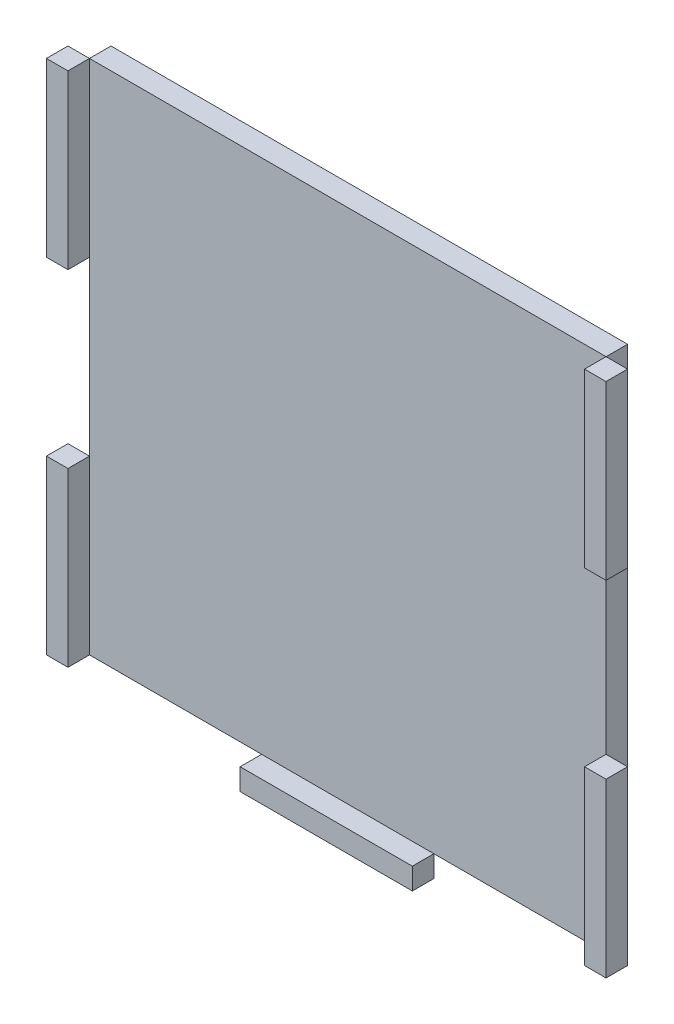
ISO-10303-21;
HEADER;
FILE_DESCRIPTION(('STEP AP214'),'2;1');
FILE_NAME('part.step','',(''),(''),'','','');
FILE_SCHEMA(('AUTOMOTIVE_DESIGN { 1 0 10303 214 1 1 1 1 }'));
ENDSEC;
DATA;
#1=APPLICATION_CONTEXT('core data for automotive mechanical design processes');
#2=APPLICATION_PROTOCOL_DEFINITION('international standard','automotive_design',2000,#1);
#3=PRODUCT_CONTEXT('',#1,'mechanical');
#4=PRODUCT('Part','Part','',(#3));
#5=PRODUCT_RELATED_PRODUCT_CATEGORY('part','',(#4));
#6=PRODUCT_DEFINITION_FORMATION('','',#4);
#7=PRODUCT_DEFINITION_CONTEXT('part definition',#1,'design');
#8=PRODUCT_DEFINITION('design','',#6,#7);
#9=PRODUCT_DEFINITION_SHAPE('','',#8);
#10=(LENGTH_UNIT() NAMED_UNIT(*) SI_UNIT(.MILLI.,.METRE.));
#11=(NAMED_UNIT(*) PLANE_ANGLE_UNIT() SI_UNIT($,.RADIAN.));
#12=(NAMED_UNIT(*) SI_UNIT($,.STERADIAN.) SOLID_ANGLE_UNIT());
#13=UNCERTAINTY_MEASURE_WITH_UNIT(LENGTH_MEASURE(1.E-05),#10,'distance_accuracy_value','');
#14=(GEOMETRIC_REPRESENTATION_CONTEXT(3) GLOBAL_UNCERTAINTY_ASSIGNED_CONTEXT((#13)) GLOBAL_UNIT_ASSIGNED_CONTEXT((#10,
#11,#12)) REPRESENTATION_CONTEXT('',''));
#15=CARTESIAN_POINT('',(0.,0.,0.));
#16=DIRECTION('',(0.,0.,1.));
#17=DIRECTION('',(1.,0.,0.));
#18=AXIS2_PLACEMENT_3D('',#15,#16,#17);
#19=CARTESIAN_POINT('',(38.1,-38.1,6.35));
#20=DIRECTION('',(1.,0.,0.));
#21=DIRECTION('',(0.,0.,-1.));
#22=AXIS2_PLACEMENT_3D('',#19,#20,#21);
#23=PLANE('',#22);
#24=DIRECTION('',(0.,-1.,0.));
#25=VECTOR('',#24,1.);
#26=CARTESIAN_POINT('',(38.1,-38.1,3.175));
#27=LINE('',#26,#25);
#28=CARTESIAN_POINT('',(38.1,-12.7,3.175));
#29=VERTEX_POINT('',#28);
#30=CARTESIAN_POINT('',(38.1,-38.1,3.175));
#31=VERTEX_POINT('',#30);
#32=EDGE_CURVE('E113',#29,#31,#27,.T.);
#33=ORIENTED_EDGE('',*,*,#32,.T.);
#34=DIRECTION('',(0.,0.,-1.));
#35=VECTOR('',#34,1.);
#36=CARTESIAN_POINT('',(38.1,-38.1,6.35));
#37=LINE('',#36,#35);
#38=CARTESIAN_POINT('',(38.1,-38.1,6.35));
#39=VERTEX_POINT('',#38);
#40=EDGE_CURVE('E12',#39,#31,#37,.T.);
#41=ORIENTED_EDGE('',*,*,#40,.F.);
#42=DIRECTION('',(0.,-1.,0.));
#43=VECTOR('',#42,1.);
#44=CARTESIAN_POINT('',(38.1,-38.1,6.35));
#45=LINE('',#44,#43);
#46=CARTESIAN_POINT('',(38.1,-12.7,6.35));
#47=VERTEX_POINT('',#46);
#48=EDGE_CURVE('E101',#47,#39,#45,.T.);
#49=ORIENTED_EDGE('',*,*,#48,.F.);
#50=DIRECTION('',(0.,0.,-1.));
#51=VECTOR('',#50,1.);
#52=CARTESIAN_POINT('',(38.1,-12.7,6.35));
#53=LINE('',#52,#51);
#54=EDGE_CURVE('E109',#47,#29,#53,.T.);
#55=ORIENTED_EDGE('',*,*,#54,.T.);
#56=EDGE_LOOP('',(#33,#41,#49,#55));
#57=FACE_BOUND('',#56,.T.);
#58=ADVANCED_FACE('F50',(#57),#23,.F.);
#59=CARTESIAN_POINT('',(38.1,-38.1,6.35));
#60=DIRECTION('',(0.,1.,0.));
#61=DIRECTION('',(0.,0.,1.));
#62=AXIS2_PLACEMENT_3D('',#59,#60,#61);
#63=PLANE('',#62);
#64=DIRECTION('',(1.,0.,0.));
#65=VECTOR('',#64,1.);
#66=CARTESIAN_POINT('',(38.1,-38.1,3.175));
#67=LINE('',#66,#65);
#68=CARTESIAN_POINT('',(41.275,-38.1,3.175));
#69=VERTEX_POINT('',#68);
#70=EDGE_CURVE('E105',#31,#69,#67,.T.);
#71=ORIENTED_EDGE('',*,*,#70,.T.);
#72=DIRECTION('',(0.,0.,-1.));
#73=VECTOR('',#72,1.);
#74=CARTESIAN_POINT('',(41.275,-38.1,6.35));
#75=LINE('',#74,#73);
#76=CARTESIAN_POINT('',(41.275,-38.1,6.35));
#77=VERTEX_POINT('',#76);
#78=EDGE_CURVE('E58',#77,#69,#75,.T.);
#79=ORIENTED_EDGE('',*,*,#78,.F.);
#80=DIRECTION('',(1.,0.,0.));
#81=VECTOR('',#80,1.);
#82=CARTESIAN_POINT('',(38.1,-38.1,6.35));
#83=LINE('',#82,#81);
#84=EDGE_CURVE('E96',#39,#77,#83,.T.);
#85=ORIENTED_EDGE('',*,*,#84,.F.);
#86=ORIENTED_EDGE('',*,*,#40,.T.);
#87=EDGE_LOOP('',(#71,#79,#85,#86));
#88=FACE_BOUND('',#87,.T.);
#89=ADVANCED_FACE('F104',(#88),#63,.F.);
#90=CARTESIAN_POINT('',(41.275,-38.1,6.35));
#91=DIRECTION('',(-1.,0.,0.));
#92=DIRECTION('',(0.,0.,1.));
#93=AXIS2_PLACEMENT_3D('',#90,#91,#92);
#94=PLANE('',#93);
#95=DIRECTION('',(0.,1.,0.));
#96=VECTOR('',#95,1.);
#97=CARTESIAN_POINT('',(41.275,-38.1,3.175));
#98=LINE('',#97,#96);
#99=CARTESIAN_POINT('',(41.275,-12.7,3.175));
#100=VERTEX_POINT('',#99);
#101=EDGE_CURVE('E83',#69,#100,#98,.T.);
#102=ORIENTED_EDGE('',*,*,#101,.T.);
#103=DIRECTION('',(0.,0.,-1.));
#104=VECTOR('',#103,1.);
#105=CARTESIAN_POINT('',(41.275,-12.7,6.35));
#106=LINE('',#105,#104);
#107=CARTESIAN_POINT('',(41.275,-12.7,6.35));
#108=VERTEX_POINT('',#107);
#109=EDGE_CURVE('E106',#108,#100,#106,.T.);
#110=ORIENTED_EDGE('',*,*,#109,.F.);
#111=DIRECTION('',(0.,1.,0.));
#112=VECTOR('',#111,1.);
#113=CARTESIAN_POINT('',(41.275,-38.1,6.35));
#114=LINE('',#113,#112);
#115=EDGE_CURVE('E99',#77,#108,#114,.T.);
#116=ORIENTED_EDGE('',*,*,#115,.F.);
#117=ORIENTED_EDGE('',*,*,#78,.T.);
#118=EDGE_LOOP('',(#102,#110,#116,#117));
#119=FACE_BOUND('',#118,.T.);
#120=ADVANCED_FACE('F107',(#119),#94,.F.);
#121=CARTESIAN_POINT('',(38.1,-12.7,6.35));
#122=DIRECTION('',(0.,-1.,0.));
#123=DIRECTION('',(0.,0.,-1.));
#124=AXIS2_PLACEMENT_3D('',#121,#122,#123);
#125=PLANE('',#124);
#126=DIRECTION('',(-1.,0.,0.));
#127=VECTOR('',#126,1.);
#128=CARTESIAN_POINT('',(38.1,-12.7,3.175));
#129=LINE('',#128,#127);
#130=EDGE_CURVE('E89',#100,#29,#129,.T.);
#131=ORIENTED_EDGE('',*,*,#130,.T.);
#132=ORIENTED_EDGE('',*,*,#54,.F.);
#133=DIRECTION('',(-1.,0.,0.));
#134=VECTOR('',#133,1.);
#135=CARTESIAN_POINT('',(38.1,-12.7,6.35));
#136=LINE('',#135,#134);
#137=EDGE_CURVE('E66',#108,#47,#136,.T.);
#138=ORIENTED_EDGE('',*,*,#137,.F.);
#139=ORIENTED_EDGE('',*,*,#109,.T.);
#140=EDGE_LOOP('',(#131,#132,#138,#139));
#141=FACE_BOUND('',#140,.T.);
#142=ADVANCED_FACE('F120',(#141),#125,.F.);
#143=CARTESIAN_POINT('',(0.,0.,6.35));
#144=DIRECTION('',(0.,0.,-1.));
#145=DIRECTION('',(-1.,0.,0.));
#146=AXIS2_PLACEMENT_3D('',#143,#144,#145);
#147=PLANE('',#146);
#148=ORIENTED_EDGE('',*,*,#48,.T.);
#149=ORIENTED_EDGE('',*,*,#84,.T.);
#150=ORIENTED_EDGE('',*,*,#115,.T.);
#151=ORIENTED_EDGE('',*,*,#137,.T.);
#152=EDGE_LOOP('',(#148,#149,#150,#151));
#153=FACE_BOUND('',#152,.T.);
#154=ADVANCED_FACE('F97',(#153),#147,.F.);
#155=CARTESIAN_POINT('',(0.,0.,3.175));
#156=DIRECTION('',(0.,0.,-1.));
#157=DIRECTION('',(-1.,0.,0.));
#158=AXIS2_PLACEMENT_3D('',#155,#156,#157);
#159=PLANE('',#158);
#160=ORIENTED_EDGE('',*,*,#32,.F.);
#161=ORIENTED_EDGE('',*,*,#130,.F.);
#162=ORIENTED_EDGE('',*,*,#101,.F.);
#163=ORIENTED_EDGE('',*,*,#70,.F.);
#164=EDGE_LOOP('',(#160,#161,#162,#163));
#165=FACE_BOUND('',#164,.T.);
#166=ADVANCED_FACE('F123',(#165),#159,.T.);
#167=CLOSED_SHELL('',(#58,#89,#120,#142,#154,#166));
#168=MANIFOLD_SOLID_BREP('B2',#167);
#169=CARTESIAN_POINT('',(38.1,38.1,6.35));
#170=DIRECTION('',(1.,0.,0.));
#171=DIRECTION('',(0.,0.,-1.));
#172=AXIS2_PLACEMENT_3D('',#169,#170,#171);
#173=PLANE('',#172);
#174=DIRECTION('',(0.,-1.,0.));
#175=VECTOR('',#174,1.);
#176=CARTESIAN_POINT('',(38.1,38.1,3.175));
#177=LINE('',#176,#175);
#178=CARTESIAN_POINT('',(38.1,38.1,3.175));
#179=VERTEX_POINT('',#178);
#180=CARTESIAN_POINT('',(38.1,12.7,3.175));
#181=VERTEX_POINT('',#180);
#182=EDGE_CURVE('E247',#179,#181,#177,.T.);
#183=ORIENTED_EDGE('',*,*,#182,.T.);
#184=DIRECTION('',(0.,0.,-1.));
#185=VECTOR('',#184,1.);
#186=CARTESIAN_POINT('',(38.1,12.7,6.35));
#187=LINE('',#186,#185);
#188=CARTESIAN_POINT('',(38.1,12.7,6.35));
#189=VERTEX_POINT('',#188);
#190=EDGE_CURVE('E48',#189,#181,#187,.T.);
#191=ORIENTED_EDGE('',*,*,#190,.F.);
#192=DIRECTION('',(0.,-1.,0.));
#193=VECTOR('',#192,1.);
#194=CARTESIAN_POINT('',(38.1,38.1,6.35));
#195=LINE('',#194,#193);
#196=CARTESIAN_POINT('',(38.1,38.1,6.35));
#197=VERTEX_POINT('',#196);
#198=EDGE_CURVE('E235',#197,#189,#195,.T.);
#199=ORIENTED_EDGE('',*,*,#198,.F.);
#200=DIRECTION('',(0.,0.,-1.));
#201=VECTOR('',#200,1.);
#202=CARTESIAN_POINT('',(38.1,38.1,6.35));
#203=LINE('',#202,#201);
#204=EDGE_CURVE('E243',#197,#179,#203,.T.);
#205=ORIENTED_EDGE('',*,*,#204,.T.);
#206=EDGE_LOOP('',(#183,#191,#199,#205));
#207=FACE_BOUND('',#206,.T.);
#208=ADVANCED_FACE('F184',(#207),#173,.F.);
#209=CARTESIAN_POINT('',(38.1,12.7,6.35));
#210=DIRECTION('',(0.,1.,0.));
#211=DIRECTION('',(0.,0.,1.));
#212=AXIS2_PLACEMENT_3D('',#209,#210,#211);
#213=PLANE('',#212);
#214=DIRECTION('',(1.,0.,0.));
#215=VECTOR('',#214,1.);
#216=CARTESIAN_POINT('',(38.1,12.7,3.175));
#217=LINE('',#216,#215);
#218=CARTESIAN_POINT('',(41.275,12.7,3.175));
#219=VERTEX_POINT('',#218);
#220=EDGE_CURVE('E239',#181,#219,#217,.T.);
#221=ORIENTED_EDGE('',*,*,#220,.T.);
#222=DIRECTION('',(0.,0.,-1.));
#223=VECTOR('',#222,1.);
#224=CARTESIAN_POINT('',(41.275,12.7,6.35));
#225=LINE('',#224,#223);
#226=CARTESIAN_POINT('',(41.275,12.7,6.35));
#227=VERTEX_POINT('',#226);
#228=EDGE_CURVE('E192',#227,#219,#225,.T.);
#229=ORIENTED_EDGE('',*,*,#228,.F.);
#230=DIRECTION('',(1.,0.,0.));
#231=VECTOR('',#230,1.);
#232=CARTESIAN_POINT('',(38.1,12.7,6.35));
#233=LINE('',#232,#231);
#234=EDGE_CURVE('E230',#189,#227,#233,.T.);
#235=ORIENTED_EDGE('',*,*,#234,.F.);
#236=ORIENTED_EDGE('',*,*,#190,.T.);
#237=EDGE_LOOP('',(#221,#229,#235,#236));
#238=FACE_BOUND('',#237,.T.);
#239=ADVANCED_FACE('F238',(#238),#213,.F.);
#240=CARTESIAN_POINT('',(41.275,38.1,6.35));
#241=DIRECTION('',(-1.,0.,0.));
#242=DIRECTION('',(0.,0.,1.));
#243=AXIS2_PLACEMENT_3D('',#240,#241,#242);
#244=PLANE('',#243);
#245=DIRECTION('',(0.,1.,0.));
#246=VECTOR('',#245,1.);
#247=CARTESIAN_POINT('',(41.275,38.1,3.175));
#248=LINE('',#247,#246);
#249=CARTESIAN_POINT('',(41.275,38.1,3.175));
#250=VERTEX_POINT('',#249);
#251=EDGE_CURVE('E217',#219,#250,#248,.T.);
#252=ORIENTED_EDGE('',*,*,#251,.T.);
#253=DIRECTION('',(0.,0.,-1.));
#254=VECTOR('',#253,1.);
#255=CARTESIAN_POINT('',(41.275,38.1,6.35));
#256=LINE('',#255,#254);
#257=CARTESIAN_POINT('',(41.275,38.1,6.35));
#258=VERTEX_POINT('',#257);
#259=EDGE_CURVE('E240',#258,#250,#256,.T.);
#260=ORIENTED_EDGE('',*,*,#259,.F.);
#261=DIRECTION('',(0.,1.,0.));
#262=VECTOR('',#261,1.);
#263=CARTESIAN_POINT('',(41.275,38.1,6.35));
#264=LINE('',#263,#262);
#265=EDGE_CURVE('E233',#227,#258,#264,.T.);
#266=ORIENTED_EDGE('',*,*,#265,.F.);
#267=ORIENTED_EDGE('',*,*,#228,.T.);
#268=EDGE_LOOP('',(#252,#260,#266,#267));
#269=FACE_BOUND('',#268,.T.);
#270=ADVANCED_FACE('F241',(#269),#244,.F.);
#271=CARTESIAN_POINT('',(38.1,38.1,6.35));
#272=DIRECTION('',(0.,-1.,0.));
#273=DIRECTION('',(0.,0.,-1.));
#274=AXIS2_PLACEMENT_3D('',#271,#272,#273);
#275=PLANE('',#274);
#276=DIRECTION('',(-1.,0.,0.));
#277=VECTOR('',#276,1.);
#278=CARTESIAN_POINT('',(38.1,38.1,3.175));
#279=LINE('',#278,#277);
#280=EDGE_CURVE('E223',#250,#179,#279,.T.);
#281=ORIENTED_EDGE('',*,*,#280,.T.);
#282=ORIENTED_EDGE('',*,*,#204,.F.);
#283=DIRECTION('',(-1.,0.,0.));
#284=VECTOR('',#283,1.);
#285=CARTESIAN_POINT('',(38.1,38.1,6.35));
#286=LINE('',#285,#284);
#287=EDGE_CURVE('E200',#258,#197,#286,.T.);
#288=ORIENTED_EDGE('',*,*,#287,.F.);
#289=ORIENTED_EDGE('',*,*,#259,.T.);
#290=EDGE_LOOP('',(#281,#282,#288,#289));
#291=FACE_BOUND('',#290,.T.);
#292=ADVANCED_FACE('F254',(#291),#275,.F.);
#293=CARTESIAN_POINT('',(0.,0.,6.35));
#294=DIRECTION('',(0.,0.,1.));
#295=DIRECTION('',(1.,0.,0.));
#296=AXIS2_PLACEMENT_3D('',#293,#294,#295);
#297=PLANE('',#296);
#298=ORIENTED_EDGE('',*,*,#198,.T.);
#299=ORIENTED_EDGE('',*,*,#234,.T.);
#300=ORIENTED_EDGE('',*,*,#265,.T.);
#301=ORIENTED_EDGE('',*,*,#287,.T.);
#302=EDGE_LOOP('',(#298,#299,#300,#301));
#303=FACE_BOUND('',#302,.T.);
#304=ADVANCED_FACE('F231',(#303),#297,.T.);
#305=CARTESIAN_POINT('',(0.,0.,3.175));
#306=DIRECTION('',(0.,0.,1.));
#307=DIRECTION('',(1.,0.,0.));
#308=AXIS2_PLACEMENT_3D('',#305,#306,#307);
#309=PLANE('',#308);
#310=ORIENTED_EDGE('',*,*,#182,.F.);
#311=ORIENTED_EDGE('',*,*,#280,.F.);
#312=ORIENTED_EDGE('',*,*,#251,.F.);
#313=ORIENTED_EDGE('',*,*,#220,.F.);
#314=EDGE_LOOP('',(#310,#311,#312,#313));
#315=FACE_BOUND('',#314,.T.);
#316=ADVANCED_FACE('F257',(#315),#309,.F.);
#317=CLOSED_SHELL('',(#208,#239,#270,#292,#304,#316));
#318=MANIFOLD_SOLID_BREP('B6',#317);
#319=CARTESIAN_POINT('',(-12.7,-38.1,6.35));
#320=DIRECTION('',(1.,0.,0.));
#321=DIRECTION('',(0.,0.,-1.));
#322=AXIS2_PLACEMENT_3D('',#319,#320,#321);
#323=PLANE('',#322);
#324=DIRECTION('',(0.,-1.,0.));
#325=VECTOR('',#324,1.);
#326=CARTESIAN_POINT('',(-12.7,-38.1,3.175));
#327=LINE('',#326,#325);
#328=CARTESIAN_POINT('',(-12.7,-38.1,3.175));
#329=VERTEX_POINT('',#328);
#330=CARTESIAN_POINT('',(-12.7,-41.275,3.175));
#331=VERTEX_POINT('',#330);
#332=EDGE_CURVE('E381',#329,#331,#327,.T.);
#333=ORIENTED_EDGE('',*,*,#332,.T.);
#334=DIRECTION('',(0.,0.,-1.));
#335=VECTOR('',#334,1.);
#336=CARTESIAN_POINT('',(-12.7,-41.275,6.35));
#337=LINE('',#336,#335);
#338=CARTESIAN_POINT('',(-12.7,-41.275,6.35));
#339=VERTEX_POINT('',#338);
#340=EDGE_CURVE('E182',#339,#331,#337,.T.);
#341=ORIENTED_EDGE('',*,*,#340,.F.);
#342=DIRECTION('',(0.,-1.,0.));
#343=VECTOR('',#342,1.);
#344=CARTESIAN_POINT('',(-12.7,-38.1,6.35));
#345=LINE('',#344,#343);
#346=CARTESIAN_POINT('',(-12.7,-38.1,6.35));
#347=VERTEX_POINT('',#346);
#348=EDGE_CURVE('E369',#347,#339,#345,.T.);
#349=ORIENTED_EDGE('',*,*,#348,.F.);
#350=DIRECTION('',(0.,0.,-1.));
#351=VECTOR('',#350,1.);
#352=CARTESIAN_POINT('',(-12.7,-38.1,6.35));
#353=LINE('',#352,#351);
#354=EDGE_CURVE('E377',#347,#329,#353,.T.);
#355=ORIENTED_EDGE('',*,*,#354,.T.);
#356=EDGE_LOOP('',(#333,#341,#349,#355));
#357=FACE_BOUND('',#356,.T.);
#358=ADVANCED_FACE('F318',(#357),#323,.F.);
#359=CARTESIAN_POINT('',(-12.7,-41.275,6.35));
#360=DIRECTION('',(0.,1.,0.));
#361=DIRECTION('',(0.,0.,1.));
#362=AXIS2_PLACEMENT_3D('',#359,#360,#361);
#363=PLANE('',#362);
#364=DIRECTION('',(1.,0.,0.));
#365=VECTOR('',#364,1.);
#366=CARTESIAN_POINT('',(-12.7,-41.275,3.175));
#367=LINE('',#366,#365);
#368=CARTESIAN_POINT('',(12.7,-41.275,3.175));
#369=VERTEX_POINT('',#368);
#370=EDGE_CURVE('E373',#331,#369,#367,.T.);
#371=ORIENTED_EDGE('',*,*,#370,.T.);
#372=DIRECTION('',(0.,0.,-1.));
#373=VECTOR('',#372,1.);
#374=CARTESIAN_POINT('',(12.7,-41.275,6.35));
#375=LINE('',#374,#373);
#376=CARTESIAN_POINT('',(12.7,-41.275,6.35));
#377=VERTEX_POINT('',#376);
#378=EDGE_CURVE('E326',#377,#369,#375,.T.);
#379=ORIENTED_EDGE('',*,*,#378,.F.);
#380=DIRECTION('',(1.,0.,0.));
#381=VECTOR('',#380,1.);
#382=CARTESIAN_POINT('',(-12.7,-41.275,6.35));
#383=LINE('',#382,#381);
#384=EDGE_CURVE('E364',#339,#377,#383,.T.);
#385=ORIENTED_EDGE('',*,*,#384,.F.);
#386=ORIENTED_EDGE('',*,*,#340,.T.);
#387=EDGE_LOOP('',(#371,#379,#385,#386));
#388=FACE_BOUND('',#387,.T.);
#389=ADVANCED_FACE('F372',(#388),#363,.F.);
#390=CARTESIAN_POINT('',(12.7,-38.1,6.35));
#391=DIRECTION('',(-1.,0.,0.));
#392=DIRECTION('',(0.,0.,1.));
#393=AXIS2_PLACEMENT_3D('',#390,#391,#392);
#394=PLANE('',#393);
#395=DIRECTION('',(0.,1.,0.));
#396=VECTOR('',#395,1.);
#397=CARTESIAN_POINT('',(12.7,-38.1,3.175));
#398=LINE('',#397,#396);
#399=CARTESIAN_POINT('',(12.7,-38.1,3.175));
#400=VERTEX_POINT('',#399);
#401=EDGE_CURVE('E351',#369,#400,#398,.T.);
#402=ORIENTED_EDGE('',*,*,#401,.T.);
#403=DIRECTION('',(0.,0.,-1.));
#404=VECTOR('',#403,1.);
#405=CARTESIAN_POINT('',(12.7,-38.1,6.35));
#406=LINE('',#405,#404);
#407=CARTESIAN_POINT('',(12.7,-38.1,6.35));
#408=VERTEX_POINT('',#407);
#409=EDGE_CURVE('E374',#408,#400,#406,.T.);
#410=ORIENTED_EDGE('',*,*,#409,.F.);
#411=DIRECTION('',(0.,1.,0.));
#412=VECTOR('',#411,1.);
#413=CARTESIAN_POINT('',(12.7,-38.1,6.35));
#414=LINE('',#413,#412);
#415=EDGE_CURVE('E367',#377,#408,#414,.T.);
#416=ORIENTED_EDGE('',*,*,#415,.F.);
#417=ORIENTED_EDGE('',*,*,#378,.T.);
#418=EDGE_LOOP('',(#402,#410,#416,#417));
#419=FACE_BOUND('',#418,.T.);
#420=ADVANCED_FACE('F375',(#419),#394,.F.);
#421=CARTESIAN_POINT('',(-12.7,-38.1,6.35));
#422=DIRECTION('',(0.,-1.,0.));
#423=DIRECTION('',(0.,0.,-1.));
#424=AXIS2_PLACEMENT_3D('',#421,#422,#423);
#425=PLANE('',#424);
#426=DIRECTION('',(-1.,0.,0.));
#427=VECTOR('',#426,1.);
#428=CARTESIAN_POINT('',(-12.7,-38.1,3.175));
#429=LINE('',#428,#427);
#430=EDGE_CURVE('E357',#400,#329,#429,.T.);
#431=ORIENTED_EDGE('',*,*,#430,.T.);
#432=ORIENTED_EDGE('',*,*,#354,.F.);
#433=DIRECTION('',(-1.,0.,0.));
#434=VECTOR('',#433,1.);
#435=CARTESIAN_POINT('',(-12.7,-38.1,6.35));
#436=LINE('',#435,#434);
#437=EDGE_CURVE('E334',#408,#347,#436,.T.);
#438=ORIENTED_EDGE('',*,*,#437,.F.);
#439=ORIENTED_EDGE('',*,*,#409,.T.);
#440=EDGE_LOOP('',(#431,#432,#438,#439));
#441=FACE_BOUND('',#440,.T.);
#442=ADVANCED_FACE('F388',(#441),#425,.F.);
#443=CARTESIAN_POINT('',(0.,0.,6.35));
#444=DIRECTION('',(0.,0.,1.));
#445=DIRECTION('',(1.,0.,0.));
#446=AXIS2_PLACEMENT_3D('',#443,#444,#445);
#447=PLANE('',#446);
#448=ORIENTED_EDGE('',*,*,#348,.T.);
#449=ORIENTED_EDGE('',*,*,#384,.T.);
#450=ORIENTED_EDGE('',*,*,#415,.T.);
#451=ORIENTED_EDGE('',*,*,#437,.T.);
#452=EDGE_LOOP('',(#448,#449,#450,#451));
#453=FACE_BOUND('',#452,.T.);
#454=ADVANCED_FACE('F365',(#453),#447,.T.);
#455=CARTESIAN_POINT('',(0.,0.,3.175));
#456=DIRECTION('',(0.,0.,1.));
#457=DIRECTION('',(1.,0.,0.));
#458=AXIS2_PLACEMENT_3D('',#455,#456,#457);
#459=PLANE('',#458);
#460=ORIENTED_EDGE('',*,*,#332,.F.);
#461=ORIENTED_EDGE('',*,*,#430,.F.);
#462=ORIENTED_EDGE('',*,*,#401,.F.);
#463=ORIENTED_EDGE('',*,*,#370,.F.);
#464=EDGE_LOOP('',(#460,#461,#462,#463));
#465=FACE_BOUND('',#464,.T.);
#466=ADVANCED_FACE('F391',(#465),#459,.F.);
#467=CLOSED_SHELL('',(#358,#389,#420,#442,#454,#466));
#468=MANIFOLD_SOLID_BREP('B42',#467);
#469=CARTESIAN_POINT('',(-38.1,-38.1,6.35));
#470=DIRECTION('',(-1.,0.,0.));
#471=DIRECTION('',(0.,0.,1.));
#472=AXIS2_PLACEMENT_3D('',#469,#470,#471);
#473=PLANE('',#472);
#474=DIRECTION('',(0.,1.,0.));
#475=VECTOR('',#474,1.);
#476=CARTESIAN_POINT('',(-38.1,-38.1,3.175));
#477=LINE('',#476,#475);
#478=CARTESIAN_POINT('',(-38.1,-38.1,3.175));
#479=VERTEX_POINT('',#478);
#480=CARTESIAN_POINT('',(-38.1,-12.7,3.175));
#481=VERTEX_POINT('',#480);
#482=EDGE_CURVE('E515',#479,#481,#477,.T.);
#483=ORIENTED_EDGE('',*,*,#482,.T.);
#484=DIRECTION('',(0.,0.,-1.));
#485=VECTOR('',#484,1.);
#486=CARTESIAN_POINT('',(-38.1,-12.7,6.35));
#487=LINE('',#486,#485);
#488=CARTESIAN_POINT('',(-38.1,-12.7,6.35));
#489=VERTEX_POINT('',#488);
#490=EDGE_CURVE('E316',#489,#481,#487,.T.);
#491=ORIENTED_EDGE('',*,*,#490,.F.);
#492=DIRECTION('',(0.,1.,0.));
#493=VECTOR('',#492,1.);
#494=CARTESIAN_POINT('',(-38.1,-38.1,6.35));
#495=LINE('',#494,#493);
#496=CARTESIAN_POINT('',(-38.1,-38.1,6.35));
#497=VERTEX_POINT('',#496);
#498=EDGE_CURVE('E503',#497,#489,#495,.T.);
#499=ORIENTED_EDGE('',*,*,#498,.F.);
#500=DIRECTION('',(0.,0.,-1.));
#501=VECTOR('',#500,1.);
#502=CARTESIAN_POINT('',(-38.1,-38.1,6.35));
#503=LINE('',#502,#501);
#504=EDGE_CURVE('E511',#497,#479,#503,.T.);
#505=ORIENTED_EDGE('',*,*,#504,.T.);
#506=EDGE_LOOP('',(#483,#491,#499,#505));
#507=FACE_BOUND('',#506,.T.);
#508=ADVANCED_FACE('F452',(#507),#473,.F.);
#509=CARTESIAN_POINT('',(-38.1,-12.7,6.35));
#510=DIRECTION('',(0.,-1.,0.));
#511=DIRECTION('',(1.,0.,0.));
#512=AXIS2_PLACEMENT_3D('',#509,#510,#511);
#513=PLANE('',#512);
#514=DIRECTION('',(-1.,0.,0.));
#515=VECTOR('',#514,1.);
#516=CARTESIAN_POINT('',(-38.1,-12.7,3.175));
#517=LINE('',#516,#515);
#518=CARTESIAN_POINT('',(-41.275,-12.7,3.175));
#519=VERTEX_POINT('',#518);
#520=EDGE_CURVE('E507',#481,#519,#517,.T.);
#521=ORIENTED_EDGE('',*,*,#520,.T.);
#522=DIRECTION('',(0.,0.,-1.));
#523=VECTOR('',#522,1.);
#524=CARTESIAN_POINT('',(-41.275,-12.7,6.35));
#525=LINE('',#524,#523);
#526=CARTESIAN_POINT('',(-41.275,-12.7,6.35));
#527=VERTEX_POINT('',#526);
#528=EDGE_CURVE('E460',#527,#519,#525,.T.);
#529=ORIENTED_EDGE('',*,*,#528,.F.);
#530=DIRECTION('',(-1.,0.,0.));
#531=VECTOR('',#530,1.);
#532=CARTESIAN_POINT('',(-38.1,-12.7,6.35));
#533=LINE('',#532,#531);
#534=EDGE_CURVE('E498',#489,#527,#533,.T.);
#535=ORIENTED_EDGE('',*,*,#534,.F.);
#536=ORIENTED_EDGE('',*,*,#490,.T.);
#537=EDGE_LOOP('',(#521,#529,#535,#536));
#538=FACE_BOUND('',#537,.T.);
#539=ADVANCED_FACE('F506',(#538),#513,.F.);
#540=CARTESIAN_POINT('',(-41.275,-38.1,6.35));
#541=DIRECTION('',(1.,0.,0.));
#542=DIRECTION('',(0.,0.,-1.));
#543=AXIS2_PLACEMENT_3D('',#540,#541,#542);
#544=PLANE('',#543);
#545=DIRECTION('',(0.,-1.,0.));
#546=VECTOR('',#545,1.);
#547=CARTESIAN_POINT('',(-41.275,-38.1,3.175));
#548=LINE('',#547,#546);
#549=CARTESIAN_POINT('',(-41.275,-38.1,3.175));
#550=VERTEX_POINT('',#549);
#551=EDGE_CURVE('E485',#519,#550,#548,.T.);
#552=ORIENTED_EDGE('',*,*,#551,.T.);
#553=DIRECTION('',(0.,0.,-1.));
#554=VECTOR('',#553,1.);
#555=CARTESIAN_POINT('',(-41.275,-38.1,6.35));
#556=LINE('',#555,#554);
#557=CARTESIAN_POINT('',(-41.275,-38.1,6.35));
#558=VERTEX_POINT('',#557);
#559=EDGE_CURVE('E508',#558,#550,#556,.T.);
#560=ORIENTED_EDGE('',*,*,#559,.F.);
#561=DIRECTION('',(0.,-1.,0.));
#562=VECTOR('',#561,1.);
#563=CARTESIAN_POINT('',(-41.275,-38.1,6.35));
#564=LINE('',#563,#562);
#565=EDGE_CURVE('E501',#527,#558,#564,.T.);
#566=ORIENTED_EDGE('',*,*,#565,.F.);
#567=ORIENTED_EDGE('',*,*,#528,.T.);
#568=EDGE_LOOP('',(#552,#560,#566,#567));
#569=FACE_BOUND('',#568,.T.);
#570=ADVANCED_FACE('F509',(#569),#544,.F.);
#571=CARTESIAN_POINT('',(-38.1,-38.1,6.35));
#572=DIRECTION('',(0.,1.,0.));
#573=DIRECTION('',(0.,0.,1.));
#574=AXIS2_PLACEMENT_3D('',#571,#572,#573);
#575=PLANE('',#574);
#576=DIRECTION('',(1.,0.,0.));
#577=VECTOR('',#576,1.);
#578=CARTESIAN_POINT('',(-38.1,-38.1,3.175));
#579=LINE('',#578,#577);
#580=EDGE_CURVE('E491',#550,#479,#579,.T.);
#581=ORIENTED_EDGE('',*,*,#580,.T.);
#582=ORIENTED_EDGE('',*,*,#504,.F.);
#583=DIRECTION('',(1.,0.,0.));
#584=VECTOR('',#583,1.);
#585=CARTESIAN_POINT('',(-38.1,-38.1,6.35));
#586=LINE('',#585,#584);
#587=EDGE_CURVE('E468',#558,#497,#586,.T.);
#588=ORIENTED_EDGE('',*,*,#587,.F.);
#589=ORIENTED_EDGE('',*,*,#559,.T.);
#590=EDGE_LOOP('',(#581,#582,#588,#589));
#591=FACE_BOUND('',#590,.T.);
#592=ADVANCED_FACE('F522',(#591),#575,.F.);
#593=CARTESIAN_POINT('',(0.,0.,6.35));
#594=DIRECTION('',(0.,0.,1.));
#595=DIRECTION('',(1.,0.,0.));
#596=AXIS2_PLACEMENT_3D('',#593,#594,#595);
#597=PLANE('',#596);
#598=ORIENTED_EDGE('',*,*,#498,.T.);
#599=ORIENTED_EDGE('',*,*,#534,.T.);
#600=ORIENTED_EDGE('',*,*,#565,.T.);
#601=ORIENTED_EDGE('',*,*,#587,.T.);
#602=EDGE_LOOP('',(#598,#599,#600,#601));
#603=FACE_BOUND('',#602,.T.);
#604=ADVANCED_FACE('F499',(#603),#597,.T.);
#605=CARTESIAN_POINT('',(0.,0.,3.175));
#606=DIRECTION('',(0.,0.,1.));
#607=DIRECTION('',(1.,0.,0.));
#608=AXIS2_PLACEMENT_3D('',#605,#606,#607);
#609=PLANE('',#608);
#610=ORIENTED_EDGE('',*,*,#482,.F.);
#611=ORIENTED_EDGE('',*,*,#580,.F.);
#612=ORIENTED_EDGE('',*,*,#551,.F.);
#613=ORIENTED_EDGE('',*,*,#520,.F.);
#614=EDGE_LOOP('',(#610,#611,#612,#613));
#615=FACE_BOUND('',#614,.T.);
#616=ADVANCED_FACE('F525',(#615),#609,.F.);
#617=CLOSED_SHELL('',(#508,#539,#570,#592,#604,#616));
#618=MANIFOLD_SOLID_BREP('B176',#617);
#619=CARTESIAN_POINT('',(-38.1,38.1,6.35));
#620=DIRECTION('',(-1.,0.,0.));
#621=DIRECTION('',(0.,0.,1.));
#622=AXIS2_PLACEMENT_3D('',#619,#620,#621);
#623=PLANE('',#622);
#624=DIRECTION('',(0.,1.,0.));
#625=VECTOR('',#624,1.);
#626=CARTESIAN_POINT('',(-38.1,38.1,3.175));
#627=LINE('',#626,#625);
#628=CARTESIAN_POINT('',(-38.1,12.7,3.175));
#629=VERTEX_POINT('',#628);
#630=CARTESIAN_POINT('',(-38.1,38.1,3.175));
#631=VERTEX_POINT('',#630);
#632=EDGE_CURVE('E648',#629,#631,#627,.T.);
#633=ORIENTED_EDGE('',*,*,#632,.T.);
#634=DIRECTION('',(0.,0.,-1.));
#635=VECTOR('',#634,1.);
#636=CARTESIAN_POINT('',(-38.1,38.1,6.35));
#637=LINE('',#636,#635);
#638=CARTESIAN_POINT('',(-38.1,38.1,6.35));
#639=VERTEX_POINT('',#638);
#640=EDGE_CURVE('E450',#639,#631,#637,.T.);
#641=ORIENTED_EDGE('',*,*,#640,.F.);
#642=DIRECTION('',(0.,1.,0.));
#643=VECTOR('',#642,1.);
#644=CARTESIAN_POINT('',(-38.1,38.1,6.35));
#645=LINE('',#644,#643);
#646=CARTESIAN_POINT('',(-38.1,12.7,6.35));
#647=VERTEX_POINT('',#646);
#648=EDGE_CURVE('E636',#647,#639,#645,.T.);
#649=ORIENTED_EDGE('',*,*,#648,.F.);
#650=DIRECTION('',(0.,0.,-1.));
#651=VECTOR('',#650,1.);
#652=CARTESIAN_POINT('',(-38.1,12.7,6.35));
#653=LINE('',#652,#651);
#654=EDGE_CURVE('E644',#647,#629,#653,.T.);
#655=ORIENTED_EDGE('',*,*,#654,.T.);
#656=EDGE_LOOP('',(#633,#641,#649,#655));
#657=FACE_BOUND('',#656,.T.);
#658=ADVANCED_FACE('F585',(#657),#623,.F.);
#659=CARTESIAN_POINT('',(-38.1,38.1,6.35));
#660=DIRECTION('',(0.,-1.,0.));
#661=DIRECTION('',(0.,0.,-1.));
#662=AXIS2_PLACEMENT_3D('',#659,#660,#661);
#663=PLANE('',#662);
#664=DIRECTION('',(-1.,0.,0.));
#665=VECTOR('',#664,1.);
#666=CARTESIAN_POINT('',(-38.1,38.1,3.175));
#667=LINE('',#666,#665);
#668=CARTESIAN_POINT('',(-41.275,38.1,3.175));
#669=VERTEX_POINT('',#668);
#670=EDGE_CURVE('E640',#631,#669,#667,.T.);
#671=ORIENTED_EDGE('',*,*,#670,.T.);
#672=DIRECTION('',(0.,0.,-1.));
#673=VECTOR('',#672,1.);
#674=CARTESIAN_POINT('',(-41.275,38.1,6.35));
#675=LINE('',#674,#673);
#676=CARTESIAN_POINT('',(-41.275,38.1,6.35));
#677=VERTEX_POINT('',#676);
#678=EDGE_CURVE('E593',#677,#669,#675,.T.);
#679=ORIENTED_EDGE('',*,*,#678,.F.);
#680=DIRECTION('',(-1.,0.,0.));
#681=VECTOR('',#680,1.);
#682=CARTESIAN_POINT('',(-38.1,38.1,6.35));
#683=LINE('',#682,#681);
#684=EDGE_CURVE('E631',#639,#677,#683,.T.);
#685=ORIENTED_EDGE('',*,*,#684,.F.);
#686=ORIENTED_EDGE('',*,*,#640,.T.);
#687=EDGE_LOOP('',(#671,#679,#685,#686));
#688=FACE_BOUND('',#687,.T.);
#689=ADVANCED_FACE('F639',(#688),#663,.F.);
#690=CARTESIAN_POINT('',(-41.275,38.1,6.35));
#691=DIRECTION('',(1.,0.,0.));
#692=DIRECTION('',(0.,0.,-1.));
#693=AXIS2_PLACEMENT_3D('',#690,#691,#692);
#694=PLANE('',#693);
#695=DIRECTION('',(0.,-1.,0.));
#696=VECTOR('',#695,1.);
#697=CARTESIAN_POINT('',(-41.275,38.1,3.175));
#698=LINE('',#697,#696);
#699=CARTESIAN_POINT('',(-41.275,12.7,3.175));
#700=VERTEX_POINT('',#699);
#701=EDGE_CURVE('E618',#669,#700,#698,.T.);
#702=ORIENTED_EDGE('',*,*,#701,.T.);
#703=DIRECTION('',(0.,0.,-1.));
#704=VECTOR('',#703,1.);
#705=CARTESIAN_POINT('',(-41.275,12.7,6.35));
#706=LINE('',#705,#704);
#707=CARTESIAN_POINT('',(-41.275,12.7,6.35));
#708=VERTEX_POINT('',#707);
#709=EDGE_CURVE('E641',#708,#700,#706,.T.);
#710=ORIENTED_EDGE('',*,*,#709,.F.);
#711=DIRECTION('',(0.,-1.,0.));
#712=VECTOR('',#711,1.);
#713=CARTESIAN_POINT('',(-41.275,38.1,6.35));
#714=LINE('',#713,#712);
#715=EDGE_CURVE('E634',#677,#708,#714,.T.);
#716=ORIENTED_EDGE('',*,*,#715,.F.);
#717=ORIENTED_EDGE('',*,*,#678,.T.);
#718=EDGE_LOOP('',(#702,#710,#716,#717));
#719=FACE_BOUND('',#718,.T.);
#720=ADVANCED_FACE('F642',(#719),#694,.F.);
#721=CARTESIAN_POINT('',(-38.1,12.7,6.35));
#722=DIRECTION('',(0.,1.,0.));
#723=DIRECTION('',(0.,0.,1.));
#724=AXIS2_PLACEMENT_3D('',#721,#722,#723);
#725=PLANE('',#724);
#726=DIRECTION('',(1.,0.,0.));
#727=VECTOR('',#726,1.);
#728=CARTESIAN_POINT('',(-38.1,12.7,3.175));
#729=LINE('',#728,#727);
#730=EDGE_CURVE('E624',#700,#629,#729,.T.);
#731=ORIENTED_EDGE('',*,*,#730,.T.);
#732=ORIENTED_EDGE('',*,*,#654,.F.);
#733=DIRECTION('',(1.,0.,0.));
#734=VECTOR('',#733,1.);
#735=CARTESIAN_POINT('',(-38.1,12.7,6.35));
#736=LINE('',#735,#734);
#737=EDGE_CURVE('E601',#708,#647,#736,.T.);
#738=ORIENTED_EDGE('',*,*,#737,.F.);
#739=ORIENTED_EDGE('',*,*,#709,.T.);
#740=EDGE_LOOP('',(#731,#732,#738,#739));
#741=FACE_BOUND('',#740,.T.);
#742=ADVANCED_FACE('F655',(#741),#725,.F.);
#743=CARTESIAN_POINT('',(0.,0.,6.35));
#744=DIRECTION('',(0.,0.,-1.));
#745=DIRECTION('',(-1.,0.,0.));
#746=AXIS2_PLACEMENT_3D('',#743,#744,#745);
#747=PLANE('',#746);
#748=ORIENTED_EDGE('',*,*,#648,.T.);
#749=ORIENTED_EDGE('',*,*,#684,.T.);
#750=ORIENTED_EDGE('',*,*,#715,.T.);
#751=ORIENTED_EDGE('',*,*,#737,.T.);
#752=EDGE_LOOP('',(#748,#749,#750,#751));
#753=FACE_BOUND('',#752,.T.);
#754=ADVANCED_FACE('F632',(#753),#747,.F.);
#755=CARTESIAN_POINT('',(0.,0.,3.175));
#756=DIRECTION('',(0.,0.,-1.));
#757=DIRECTION('',(-1.,0.,0.));
#758=AXIS2_PLACEMENT_3D('',#755,#756,#757);
#759=PLANE('',#758);
#760=ORIENTED_EDGE('',*,*,#632,.F.);
#761=ORIENTED_EDGE('',*,*,#730,.F.);
#762=ORIENTED_EDGE('',*,*,#701,.F.);
#763=ORIENTED_EDGE('',*,*,#670,.F.);
#764=EDGE_LOOP('',(#760,#761,#762,#763));
#765=FACE_BOUND('',#764,.T.);
#766=ADVANCED_FACE('F658',(#765),#759,.T.);
#767=CLOSED_SHELL('',(#658,#689,#720,#742,#754,#766));
#768=MANIFOLD_SOLID_BREP('B310',#767);
#769=CARTESIAN_POINT('',(38.1,-38.1,3.175));
#770=DIRECTION('',(-1.,0.,0.));
#771=DIRECTION('',(0.,0.,1.));
#772=AXIS2_PLACEMENT_3D('',#769,#770,#771);
#773=PLANE('',#772);
#774=DIRECTION('',(0.,1.,0.));
#775=VECTOR('',#774,1.);
#776=CARTESIAN_POINT('',(38.1,-38.1,0.));
#777=LINE('',#776,#775);
#778=CARTESIAN_POINT('',(38.1,-38.1,0.));
#779=VERTEX_POINT('',#778);
#780=CARTESIAN_POINT('',(38.1,38.1,0.));
#781=VERTEX_POINT('',#780);
#782=EDGE_CURVE('E777',#779,#781,#777,.T.);
#783=ORIENTED_EDGE('',*,*,#782,.T.);
#784=DIRECTION('',(0.,0.,-1.));
#785=VECTOR('',#784,1.);
#786=CARTESIAN_POINT('',(38.1,38.1,3.175));
#787=LINE('',#786,#785);
#788=CARTESIAN_POINT('',(38.1,38.1,3.175));
#789=VERTEX_POINT('',#788);
#790=EDGE_CURVE('E583',#789,#781,#787,.T.);
#791=ORIENTED_EDGE('',*,*,#790,.F.);
#792=DIRECTION('',(0.,1.,0.));
#793=VECTOR('',#792,1.);
#794=CARTESIAN_POINT('',(38.1,-38.1,3.175));
#795=LINE('',#794,#793);
#796=CARTESIAN_POINT('',(38.1,-38.1,3.175));
#797=VERTEX_POINT('',#796);
#798=EDGE_CURVE('E754',#797,#789,#795,.T.);
#799=ORIENTED_EDGE('',*,*,#798,.F.);
#800=DIRECTION('',(0.,0.,-1.));
#801=VECTOR('',#800,1.);
#802=CARTESIAN_POINT('',(38.1,-38.1,3.175));
#803=LINE('',#802,#801);
#804=EDGE_CURVE('E773',#797,#779,#803,.T.);
#805=ORIENTED_EDGE('',*,*,#804,.T.);
#806=EDGE_LOOP('',(#783,#791,#799,#805));
#807=FACE_BOUND('',#806,.T.);
#808=ADVANCED_FACE('F709',(#807),#773,.F.);
#809=CARTESIAN_POINT('',(-38.1,38.1,3.175));
#810=DIRECTION('',(0.,-1.,0.));
#811=DIRECTION('',(0.,0.,-1.));
#812=AXIS2_PLACEMENT_3D('',#809,#810,#811);
#813=PLANE('',#812);
#814=DIRECTION('',(-1.,0.,0.));
#815=VECTOR('',#814,1.);
#816=CARTESIAN_POINT('',(-38.1,38.1,0.));
#817=LINE('',#816,#815);
#818=CARTESIAN_POINT('',(-38.1,38.1,0.));
#819=VERTEX_POINT('',#818);
#820=EDGE_CURVE('E766',#781,#819,#817,.T.);
#821=ORIENTED_EDGE('',*,*,#820,.T.);
#822=DIRECTION('',(0.,0.,-1.));
#823=VECTOR('',#822,1.);
#824=CARTESIAN_POINT('',(-38.1,38.1,3.175));
#825=LINE('',#824,#823);
#826=CARTESIAN_POINT('',(-38.1,38.1,3.175));
#827=VERTEX_POINT('',#826);
#828=EDGE_CURVE('E718',#827,#819,#825,.T.);
#829=ORIENTED_EDGE('',*,*,#828,.F.);
#830=DIRECTION('',(-1.,0.,0.));
#831=VECTOR('',#830,1.);
#832=CARTESIAN_POINT('',(-38.1,38.1,3.175));
#833=LINE('',#832,#831);
#834=EDGE_CURVE('E756',#789,#827,#833,.T.);
#835=ORIENTED_EDGE('',*,*,#834,.F.);
#836=ORIENTED_EDGE('',*,*,#790,.T.);
#837=EDGE_LOOP('',(#821,#829,#835,#836));
#838=FACE_BOUND('',#837,.T.);
#839=ADVANCED_FACE('F765',(#838),#813,.F.);
#840=CARTESIAN_POINT('',(-38.1,-38.1,3.175));
#841=DIRECTION('',(1.,0.,0.));
#842=DIRECTION('',(0.,0.,-1.));
#843=AXIS2_PLACEMENT_3D('',#840,#841,#842);
#844=PLANE('',#843);
#845=DIRECTION('',(0.,-1.,0.));
#846=VECTOR('',#845,1.);
#847=CARTESIAN_POINT('',(-38.1,-38.1,0.));
#848=LINE('',#847,#846);
#849=CARTESIAN_POINT('',(-38.1,-38.1,0.));
#850=VERTEX_POINT('',#849);
#851=EDGE_CURVE('E743',#819,#850,#848,.T.);
#852=ORIENTED_EDGE('',*,*,#851,.T.);
#853=DIRECTION('',(0.,0.,-1.));
#854=VECTOR('',#853,1.);
#855=CARTESIAN_POINT('',(-38.1,-38.1,3.175));
#856=LINE('',#855,#854);
#857=CARTESIAN_POINT('',(-38.1,-38.1,3.175));
#858=VERTEX_POINT('',#857);
#859=EDGE_CURVE('E768',#858,#850,#856,.T.);
#860=ORIENTED_EDGE('',*,*,#859,.F.);
#861=DIRECTION('',(0.,-1.,0.));
#862=VECTOR('',#861,1.);
#863=CARTESIAN_POINT('',(-38.1,-38.1,3.175));
#864=LINE('',#863,#862);
#865=EDGE_CURVE('E760',#827,#858,#864,.T.);
#866=ORIENTED_EDGE('',*,*,#865,.F.);
#867=ORIENTED_EDGE('',*,*,#828,.T.);
#868=EDGE_LOOP('',(#852,#860,#866,#867));
#869=FACE_BOUND('',#868,.T.);
#870=ADVANCED_FACE('F769',(#869),#844,.F.);
#871=CARTESIAN_POINT('',(-38.1,-38.1,3.175));
#872=DIRECTION('',(0.,1.,0.));
#873=DIRECTION('',(0.,0.,1.));
#874=AXIS2_PLACEMENT_3D('',#871,#872,#873);
#875=PLANE('',#874);
#876=DIRECTION('',(1.,0.,0.));
#877=VECTOR('',#876,1.);
#878=CARTESIAN_POINT('',(-38.1,-38.1,0.));
#879=LINE('',#878,#877);
#880=EDGE_CURVE('E749',#850,#779,#879,.T.);
#881=ORIENTED_EDGE('',*,*,#880,.T.);
#882=ORIENTED_EDGE('',*,*,#804,.F.);
#883=DIRECTION('',(1.,0.,0.));
#884=VECTOR('',#883,1.);
#885=CARTESIAN_POINT('',(-38.1,-38.1,3.175));
#886=LINE('',#885,#884);
#887=EDGE_CURVE('E726',#858,#797,#886,.T.);
#888=ORIENTED_EDGE('',*,*,#887,.F.);
#889=ORIENTED_EDGE('',*,*,#859,.T.);
#890=EDGE_LOOP('',(#881,#882,#888,#889));
#891=FACE_BOUND('',#890,.T.);
#892=ADVANCED_FACE('F790',(#891),#875,.F.);
#893=CARTESIAN_POINT('',(0.,0.,3.175));
#894=DIRECTION('',(0.,0.,-1.));
#895=DIRECTION('',(-1.,0.,0.));
#896=AXIS2_PLACEMENT_3D('',#893,#894,#895);
#897=PLANE('',#896);
#898=ORIENTED_EDGE('',*,*,#798,.T.);
#899=ORIENTED_EDGE('',*,*,#834,.T.);
#900=ORIENTED_EDGE('',*,*,#865,.T.);
#901=ORIENTED_EDGE('',*,*,#887,.T.);
#902=EDGE_LOOP('',(#898,#899,#900,#901));
#903=FACE_BOUND('',#902,.T.);
#904=ADVANCED_FACE('F758',(#903),#897,.F.);
#905=CARTESIAN_POINT('',(0.,0.,0.));
#906=DIRECTION('',(0.,0.,-1.));
#907=DIRECTION('',(-1.,0.,0.));
#908=AXIS2_PLACEMENT_3D('',#905,#906,#907);
#909=PLANE('',#908);
#910=ORIENTED_EDGE('',*,*,#782,.F.);
#911=ORIENTED_EDGE('',*,*,#880,.F.);
#912=ORIENTED_EDGE('',*,*,#851,.F.);
#913=ORIENTED_EDGE('',*,*,#820,.F.);
#914=EDGE_LOOP('',(#910,#911,#912,#913));
#915=FACE_BOUND('',#914,.T.);
#916=ADVANCED_FACE('F793',(#915),#909,.T.);
#917=CLOSED_SHELL('',(#808,#839,#870,#892,#904,#916));
#918=MANIFOLD_SOLID_BREP('B444',#917);
#919=ADVANCED_BREP_SHAPE_REPRESENTATION('',(#18,#168,#318,#468,#618,#768,#918),#14);
#920=SHAPE_DEFINITION_REPRESENTATION(#9,#919);
ENDSEC;
END-ISO-10303-21;
